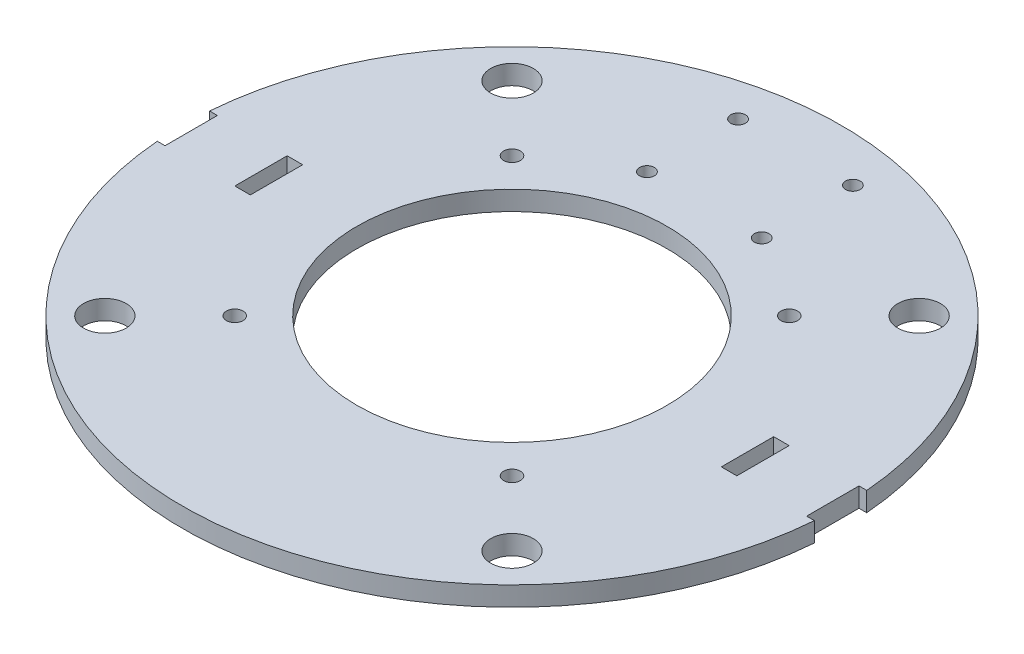
ISO-10303-21;
HEADER;
FILE_DESCRIPTION(('STEP AP214'),'2;1');
FILE_NAME('part.step','',(''),(''),'','','');
FILE_SCHEMA(('AUTOMOTIVE_DESIGN { 1 0 10303 214 1 1 1 1 }'));
ENDSEC;
DATA;
#1=APPLICATION_CONTEXT('core data for automotive mechanical design processes');
#2=APPLICATION_PROTOCOL_DEFINITION('international standard','automotive_design',2000,#1);
#3=PRODUCT_CONTEXT('',#1,'mechanical');
#4=PRODUCT('Part','Part','',(#3));
#5=PRODUCT_RELATED_PRODUCT_CATEGORY('part','',(#4));
#6=PRODUCT_DEFINITION_FORMATION('','',#4);
#7=PRODUCT_DEFINITION_CONTEXT('part definition',#1,'design');
#8=PRODUCT_DEFINITION('design','',#6,#7);
#9=PRODUCT_DEFINITION_SHAPE('','',#8);
#10=(LENGTH_UNIT() NAMED_UNIT(*) SI_UNIT(.MILLI.,.METRE.));
#11=(NAMED_UNIT(*) PLANE_ANGLE_UNIT() SI_UNIT($,.RADIAN.));
#12=(NAMED_UNIT(*) SI_UNIT($,.STERADIAN.) SOLID_ANGLE_UNIT());
#13=UNCERTAINTY_MEASURE_WITH_UNIT(LENGTH_MEASURE(1.E-05),#10,'distance_accuracy_value','');
#14=(GEOMETRIC_REPRESENTATION_CONTEXT(3) GLOBAL_UNCERTAINTY_ASSIGNED_CONTEXT((#13)) GLOBAL_UNIT_ASSIGNED_CONTEXT((#10,
#11,#12)) REPRESENTATION_CONTEXT('',''));
#15=CARTESIAN_POINT('',(0.,0.,0.));
#16=DIRECTION('',(0.,0.,1.));
#17=DIRECTION('',(1.,0.,0.));
#18=AXIS2_PLACEMENT_3D('',#15,#16,#17);
#19=CARTESIAN_POINT('',(0.,5.,0.));
#20=DIRECTION('',(0.,-1.,0.));
#21=DIRECTION('',(0.,0.,-1.));
#22=AXIS2_PLACEMENT_3D('',#19,#20,#21);
#23=CYLINDRICAL_SURFACE('',#22,85.);
#24=DIRECTION('',(0.,1.,0.));
#25=VECTOR('',#24,1.);
#26=CARTESIAN_POINT('',(84.7315614160391,-0.00100000000000013,6.75));
#27=LINE('',#26,#25);
#28=CARTESIAN_POINT('',(84.7315614160391,0.,6.75));
#29=VERTEX_POINT('',#28);
#30=CARTESIAN_POINT('',(84.7315614160391,5.,6.75));
#31=VERTEX_POINT('',#30);
#32=EDGE_CURVE('E177',#29,#31,#27,.T.);
#33=ORIENTED_EDGE('',*,*,#32,.T.);
#34=CARTESIAN_POINT('',(0.,5.,0.));
#35=DIRECTION('',(0.,1.,0.));
#36=DIRECTION('',(0.,0.,1.));
#37=AXIS2_PLACEMENT_3D('',#34,#35,#36);
#38=CIRCLE('',#37,85.);
#39=CARTESIAN_POINT('',(-84.7315614160391,5.,6.75));
#40=VERTEX_POINT('',#39);
#41=EDGE_CURVE('E43',#40,#31,#38,.T.);
#42=ORIENTED_EDGE('',*,*,#41,.F.);
#43=DIRECTION('',(0.,1.,0.));
#44=VECTOR('',#43,1.);
#45=CARTESIAN_POINT('',(-84.7315614160391,-0.00100000000000013,6.75));
#46=LINE('',#45,#44);
#47=CARTESIAN_POINT('',(-84.7315614160391,0.,6.75));
#48=VERTEX_POINT('',#47);
#49=EDGE_CURVE('E213',#48,#40,#46,.T.);
#50=ORIENTED_EDGE('',*,*,#49,.F.);
#51=CARTESIAN_POINT('',(0.,0.,0.));
#52=DIRECTION('',(0.,1.,0.));
#53=DIRECTION('',(0.,0.,1.));
#54=AXIS2_PLACEMENT_3D('',#51,#52,#53);
#55=CIRCLE('',#54,85.);
#56=EDGE_CURVE('E255',#48,#29,#55,.T.);
#57=ORIENTED_EDGE('',*,*,#56,.T.);
#58=EDGE_LOOP('',(#33,#42,#50,#57));
#59=FACE_BOUND('',#58,.T.);
#60=ADVANCED_FACE('F34',(#59),#23,.T.);
#61=CARTESIAN_POINT('',(0.,5.,0.));
#62=DIRECTION('',(0.,1.,0.));
#63=DIRECTION('',(0.,0.,1.));
#64=AXIS2_PLACEMENT_3D('',#61,#62,#63);
#65=PLANE('',#64);
#66=CARTESIAN_POINT('',(-52.5,5.,-52.5));
#67=DIRECTION('',(0.,1.,0.));
#68=DIRECTION('',(0.,0.,-1.));
#69=AXIS2_PLACEMENT_3D('',#66,#67,#68);
#70=CIRCLE('',#69,5.49999999999999);
#71=CARTESIAN_POINT('',(-52.5,5.,-58.));
#72=VERTEX_POINT('',#71);
#73=EDGE_CURVE('E470',#72,#72,#70,.T.);
#74=ORIENTED_EDGE('',*,*,#73,.F.);
#75=EDGE_LOOP('',(#74));
#76=FACE_BOUND('',#75,.T.);
#77=CARTESIAN_POINT('',(52.5,5.,52.5));
#78=DIRECTION('',(0.,1.,0.));
#79=DIRECTION('',(0.,0.,-1.));
#80=AXIS2_PLACEMENT_3D('',#77,#78,#79);
#81=CIRCLE('',#80,5.49999999999999);
#82=CARTESIAN_POINT('',(52.5,5.,47.));
#83=VERTEX_POINT('',#82);
#84=EDGE_CURVE('E463',#83,#83,#81,.T.);
#85=ORIENTED_EDGE('',*,*,#84,.F.);
#86=EDGE_LOOP('',(#85));
#87=FACE_BOUND('',#86,.T.);
#88=CARTESIAN_POINT('',(-52.5,5.,52.5));
#89=DIRECTION('',(0.,1.,0.));
#90=DIRECTION('',(0.,0.,1.));
#91=AXIS2_PLACEMENT_3D('',#88,#89,#90);
#92=CIRCLE('',#91,5.49999999999999);
#93=CARTESIAN_POINT('',(-52.5,5.,58.));
#94=VERTEX_POINT('',#93);
#95=EDGE_CURVE('E458',#94,#94,#92,.T.);
#96=ORIENTED_EDGE('',*,*,#95,.F.);
#97=EDGE_LOOP('',(#96));
#98=FACE_BOUND('',#97,.T.);
#99=CARTESIAN_POINT('',(52.5,5.,-52.5));
#100=DIRECTION('',(0.,1.,0.));
#101=DIRECTION('',(0.,0.,1.));
#102=AXIS2_PLACEMENT_3D('',#99,#100,#101);
#103=CIRCLE('',#102,5.49999999999999);
#104=CARTESIAN_POINT('',(52.5,5.,-47.));
#105=VERTEX_POINT('',#104);
#106=EDGE_CURVE('E475',#105,#105,#103,.T.);
#107=ORIENTED_EDGE('',*,*,#106,.F.);
#108=EDGE_LOOP('',(#107));
#109=FACE_BOUND('',#108,.T.);
#110=CARTESIAN_POINT('',(0.,5.,0.));
#111=DIRECTION('',(0.,1.,0.));
#112=DIRECTION('',(0.,0.,1.));
#113=AXIS2_PLACEMENT_3D('',#110,#111,#112);
#114=CIRCLE('',#113,40.);
#115=CARTESIAN_POINT('',(0.,5.,40.));
#116=VERTEX_POINT('',#115);
#117=EDGE_CURVE('E484',#116,#116,#114,.T.);
#118=ORIENTED_EDGE('',*,*,#117,.F.);
#119=EDGE_LOOP('',(#118));
#120=FACE_BOUND('',#119,.T.);
#121=CARTESIAN_POINT('',(-35.75,5.,-35.75));
#122=DIRECTION('',(0.,1.,0.));
#123=DIRECTION('',(0.,0.,-1.));
#124=AXIS2_PLACEMENT_3D('',#121,#122,#123);
#125=CIRCLE('',#124,2.15);
#126=CARTESIAN_POINT('',(-35.75,5.,-37.9));
#127=VERTEX_POINT('',#126);
#128=EDGE_CURVE('E491',#127,#127,#125,.T.);
#129=ORIENTED_EDGE('',*,*,#128,.F.);
#130=EDGE_LOOP('',(#129));
#131=FACE_BOUND('',#130,.T.);
#132=CARTESIAN_POINT('',(35.75,5.,35.75));
#133=DIRECTION('',(0.,1.,0.));
#134=DIRECTION('',(0.,0.,-1.));
#135=AXIS2_PLACEMENT_3D('',#132,#133,#134);
#136=CIRCLE('',#135,2.15);
#137=CARTESIAN_POINT('',(35.75,5.,33.6));
#138=VERTEX_POINT('',#137);
#139=EDGE_CURVE('E490',#138,#138,#136,.T.);
#140=ORIENTED_EDGE('',*,*,#139,.F.);
#141=EDGE_LOOP('',(#140));
#142=FACE_BOUND('',#141,.T.);
#143=CARTESIAN_POINT('',(-35.75,5.,35.75));
#144=DIRECTION('',(0.,1.,0.));
#145=DIRECTION('',(0.,0.,1.));
#146=AXIS2_PLACEMENT_3D('',#143,#144,#145);
#147=CIRCLE('',#146,2.15);
#148=CARTESIAN_POINT('',(-35.75,5.,37.9));
#149=VERTEX_POINT('',#148);
#150=EDGE_CURVE('E487',#149,#149,#147,.T.);
#151=ORIENTED_EDGE('',*,*,#150,.F.);
#152=EDGE_LOOP('',(#151));
#153=FACE_BOUND('',#152,.T.);
#154=CARTESIAN_POINT('',(35.75,5.,-35.75));
#155=DIRECTION('',(0.,1.,0.));
#156=DIRECTION('',(0.,0.,1.));
#157=AXIS2_PLACEMENT_3D('',#154,#155,#156);
#158=CIRCLE('',#157,2.15);
#159=CARTESIAN_POINT('',(35.75,5.,-33.6));
#160=VERTEX_POINT('',#159);
#161=EDGE_CURVE('E265',#160,#160,#158,.T.);
#162=ORIENTED_EDGE('',*,*,#161,.F.);
#163=EDGE_LOOP('',(#162));
#164=FACE_BOUND('',#163,.T.);
#165=CARTESIAN_POINT('',(-14.8,5.,-73.1));
#166=DIRECTION('',(0.,1.,0.));
#167=DIRECTION('',(0.,0.,-1.));
#168=AXIS2_PLACEMENT_3D('',#165,#166,#167);
#169=CIRCLE('',#168,1.89999999999999);
#170=CARTESIAN_POINT('',(-14.8,5.,-75.));
#171=VERTEX_POINT('',#170);
#172=EDGE_CURVE('E272',#171,#171,#169,.T.);
#173=ORIENTED_EDGE('',*,*,#172,.F.);
#174=EDGE_LOOP('',(#173));
#175=FACE_BOUND('',#174,.T.);
#176=CARTESIAN_POINT('',(-14.8,5.,-49.6));
#177=DIRECTION('',(0.,1.,0.));
#178=DIRECTION('',(0.,0.,-1.));
#179=AXIS2_PLACEMENT_3D('',#176,#177,#178);
#180=CIRCLE('',#179,1.89999999999999);
#181=CARTESIAN_POINT('',(-14.8,5.,-51.5));
#182=VERTEX_POINT('',#181);
#183=EDGE_CURVE('E281',#182,#182,#180,.T.);
#184=ORIENTED_EDGE('',*,*,#183,.F.);
#185=EDGE_LOOP('',(#184));
#186=FACE_BOUND('',#185,.T.);
#187=CARTESIAN_POINT('',(14.8,5.,-49.6));
#188=DIRECTION('',(0.,1.,0.));
#189=DIRECTION('',(0.,0.,1.));
#190=AXIS2_PLACEMENT_3D('',#187,#188,#189);
#191=CIRCLE('',#190,1.89999999999999);
#192=CARTESIAN_POINT('',(14.8,5.,-47.7));
#193=VERTEX_POINT('',#192);
#194=EDGE_CURVE('E498',#193,#193,#191,.T.);
#195=ORIENTED_EDGE('',*,*,#194,.F.);
#196=EDGE_LOOP('',(#195));
#197=FACE_BOUND('',#196,.T.);
#198=CARTESIAN_POINT('',(14.8,5.,-73.1));
#199=DIRECTION('',(0.,1.,0.));
#200=DIRECTION('',(0.,0.,1.));
#201=AXIS2_PLACEMENT_3D('',#198,#199,#200);
#202=CIRCLE('',#201,1.9);
#203=CARTESIAN_POINT('',(14.8,5.,-71.2));
#204=VERTEX_POINT('',#203);
#205=EDGE_CURVE('E287',#204,#204,#202,.T.);
#206=ORIENTED_EDGE('',*,*,#205,.F.);
#207=EDGE_LOOP('',(#206));
#208=FACE_BOUND('',#207,.T.);
#209=DIRECTION('',(0.,0.,1.));
#210=VECTOR('',#209,1.);
#211=CARTESIAN_POINT('',(64.7315614160391,5.,0.));
#212=LINE('',#211,#210);
#213=CARTESIAN_POINT('',(64.7315614160391,5.,-6.75));
#214=VERTEX_POINT('',#213);
#215=CARTESIAN_POINT('',(64.7315614160391,5.,6.75));
#216=VERTEX_POINT('',#215);
#217=EDGE_CURVE('E236',#214,#216,#212,.T.);
#218=ORIENTED_EDGE('',*,*,#217,.T.);
#219=DIRECTION('',(-1.,0.,0.));
#220=VECTOR('',#219,1.);
#221=CARTESIAN_POINT('',(0.,5.,6.75));
#222=LINE('',#221,#220);
#223=CARTESIAN_POINT('',(60.7315614160391,5.,6.75));
#224=VERTEX_POINT('',#223);
#225=EDGE_CURVE('E59',#216,#224,#222,.T.);
#226=ORIENTED_EDGE('',*,*,#225,.T.);
#227=DIRECTION('',(0.,0.,1.));
#228=VECTOR('',#227,1.);
#229=CARTESIAN_POINT('',(60.7315614160391,5.,0.));
#230=LINE('',#229,#228);
#231=CARTESIAN_POINT('',(60.7315614160391,5.,-6.75));
#232=VERTEX_POINT('',#231);
#233=EDGE_CURVE('E242',#232,#224,#230,.T.);
#234=ORIENTED_EDGE('',*,*,#233,.F.);
#235=DIRECTION('',(-1.,0.,0.));
#236=VECTOR('',#235,1.);
#237=CARTESIAN_POINT('',(0.,5.,-6.75));
#238=LINE('',#237,#236);
#239=EDGE_CURVE('E239',#214,#232,#238,.T.);
#240=ORIENTED_EDGE('',*,*,#239,.F.);
#241=EDGE_LOOP('',(#218,#226,#234,#240));
#242=FACE_BOUND('',#241,.T.);
#243=DIRECTION('',(0.,0.,1.));
#244=VECTOR('',#243,1.);
#245=CARTESIAN_POINT('',(-64.7315614160391,5.,-6.75));
#246=LINE('',#245,#244);
#247=CARTESIAN_POINT('',(-64.7315614160391,5.,-6.75));
#248=VERTEX_POINT('',#247);
#249=CARTESIAN_POINT('',(-64.7315614160391,5.,6.75));
#250=VERTEX_POINT('',#249);
#251=EDGE_CURVE('E299',#248,#250,#246,.T.);
#252=ORIENTED_EDGE('',*,*,#251,.F.);
#253=DIRECTION('',(1.,0.,0.));
#254=VECTOR('',#253,1.);
#255=CARTESIAN_POINT('',(-64.7315614160391,5.,-6.75));
#256=LINE('',#255,#254);
#257=CARTESIAN_POINT('',(-60.7315614160391,5.,-6.75));
#258=VERTEX_POINT('',#257);
#259=EDGE_CURVE('E51',#248,#258,#256,.T.);
#260=ORIENTED_EDGE('',*,*,#259,.T.);
#261=DIRECTION('',(0.,0.,1.));
#262=VECTOR('',#261,1.);
#263=CARTESIAN_POINT('',(-60.7315614160391,5.,-6.75));
#264=LINE('',#263,#262);
#265=CARTESIAN_POINT('',(-60.7315614160391,5.,6.75));
#266=VERTEX_POINT('',#265);
#267=EDGE_CURVE('E157',#258,#266,#264,.T.);
#268=ORIENTED_EDGE('',*,*,#267,.T.);
#269=DIRECTION('',(1.,0.,0.));
#270=VECTOR('',#269,1.);
#271=CARTESIAN_POINT('',(-64.7315614160391,5.,6.75));
#272=LINE('',#271,#270);
#273=EDGE_CURVE('E302',#250,#266,#272,.T.);
#274=ORIENTED_EDGE('',*,*,#273,.F.);
#275=EDGE_LOOP('',(#252,#260,#268,#274));
#276=FACE_BOUND('',#275,.T.);
#277=ORIENTED_EDGE('',*,*,#41,.T.);
#278=DIRECTION('',(-1.,0.,0.));
#279=VECTOR('',#278,1.);
#280=CARTESIAN_POINT('',(0.,5.,6.75));
#281=LINE('',#280,#279);
#282=CARTESIAN_POINT('',(82.7315614160391,5.,6.75));
#283=VERTEX_POINT('',#282);
#284=EDGE_CURVE('E193',#31,#283,#281,.T.);
#285=ORIENTED_EDGE('',*,*,#284,.T.);
#286=DIRECTION('',(0.,0.,1.));
#287=VECTOR('',#286,1.);
#288=CARTESIAN_POINT('',(82.7315614160391,5.,0.));
#289=LINE('',#288,#287);
#290=CARTESIAN_POINT('',(82.7315614160391,5.,-6.75));
#291=VERTEX_POINT('',#290);
#292=EDGE_CURVE('E180',#291,#283,#289,.T.);
#293=ORIENTED_EDGE('',*,*,#292,.F.);
#294=DIRECTION('',(-1.,0.,0.));
#295=VECTOR('',#294,1.);
#296=CARTESIAN_POINT('',(0.,5.,-6.75));
#297=LINE('',#296,#295);
#298=CARTESIAN_POINT('',(84.7315614160391,5.,-6.75));
#299=VERTEX_POINT('',#298);
#300=EDGE_CURVE('E190',#299,#291,#297,.T.);
#301=ORIENTED_EDGE('',*,*,#300,.F.);
#302=CARTESIAN_POINT('',(-84.7315614160391,5.,-6.75));
#303=VERTEX_POINT('',#302);
#304=EDGE_CURVE('E11',#299,#303,#38,.T.);
#305=ORIENTED_EDGE('',*,*,#304,.T.);
#306=DIRECTION('',(1.,0.,0.));
#307=VECTOR('',#306,1.);
#308=CARTESIAN_POINT('',(0.,5.,-6.75));
#309=LINE('',#308,#307);
#310=CARTESIAN_POINT('',(-82.7315614160391,5.,-6.75));
#311=VERTEX_POINT('',#310);
#312=EDGE_CURVE('E218',#303,#311,#309,.T.);
#313=ORIENTED_EDGE('',*,*,#312,.T.);
#314=DIRECTION('',(0.,0.,1.));
#315=VECTOR('',#314,1.);
#316=CARTESIAN_POINT('',(-82.7315614160391,5.,0.));
#317=LINE('',#316,#315);
#318=CARTESIAN_POINT('',(-82.7315614160391,5.,6.75));
#319=VERTEX_POINT('',#318);
#320=EDGE_CURVE('E221',#311,#319,#317,.T.);
#321=ORIENTED_EDGE('',*,*,#320,.T.);
#322=DIRECTION('',(1.,0.,0.));
#323=VECTOR('',#322,1.);
#324=CARTESIAN_POINT('',(0.,5.,6.75));
#325=LINE('',#324,#323);
#326=EDGE_CURVE('E209',#40,#319,#325,.T.);
#327=ORIENTED_EDGE('',*,*,#326,.F.);
#328=EDGE_LOOP('',(#277,#285,#293,#301,#305,#313,#321,#327));
#329=FACE_BOUND('',#328,.T.);
#330=ADVANCED_FACE('F307',(#76,#87,#98,#109,#120,#131,#142,#153,#164,#175,#186,#197,#208,#242,
#276,#329),#65,.T.);
#331=CARTESIAN_POINT('',(0.,0.,0.));
#332=DIRECTION('',(0.,1.,0.));
#333=DIRECTION('',(0.,0.,1.));
#334=AXIS2_PLACEMENT_3D('',#331,#332,#333);
#335=PLANE('',#334);
#336=CARTESIAN_POINT('',(-52.5,0.,-52.5));
#337=DIRECTION('',(0.,1.,0.));
#338=DIRECTION('',(0.,0.,1.));
#339=AXIS2_PLACEMENT_3D('',#336,#337,#338);
#340=CIRCLE('',#339,5.49999999999999);
#341=CARTESIAN_POINT('',(-52.5,0.,-47.));
#342=VERTEX_POINT('',#341);
#343=EDGE_CURVE('E473',#342,#342,#340,.F.);
#344=ORIENTED_EDGE('',*,*,#343,.F.);
#345=EDGE_LOOP('',(#344));
#346=FACE_BOUND('',#345,.T.);
#347=CARTESIAN_POINT('',(52.5,0.,52.5));
#348=DIRECTION('',(0.,1.,0.));
#349=DIRECTION('',(0.,0.,1.));
#350=AXIS2_PLACEMENT_3D('',#347,#348,#349);
#351=CIRCLE('',#350,5.49999999999999);
#352=CARTESIAN_POINT('',(52.5,0.,58.));
#353=VERTEX_POINT('',#352);
#354=EDGE_CURVE('E466',#353,#353,#351,.F.);
#355=ORIENTED_EDGE('',*,*,#354,.F.);
#356=EDGE_LOOP('',(#355));
#357=FACE_BOUND('',#356,.T.);
#358=CARTESIAN_POINT('',(-52.5,0.,52.5));
#359=DIRECTION('',(0.,1.,0.));
#360=DIRECTION('',(0.,0.,1.));
#361=AXIS2_PLACEMENT_3D('',#358,#359,#360);
#362=CIRCLE('',#361,5.49999999999999);
#363=CARTESIAN_POINT('',(-52.5,0.,58.));
#364=VERTEX_POINT('',#363);
#365=EDGE_CURVE('E461',#364,#364,#362,.F.);
#366=ORIENTED_EDGE('',*,*,#365,.F.);
#367=EDGE_LOOP('',(#366));
#368=FACE_BOUND('',#367,.T.);
#369=CARTESIAN_POINT('',(52.5,0.,-52.5));
#370=DIRECTION('',(0.,1.,0.));
#371=DIRECTION('',(0.,0.,1.));
#372=AXIS2_PLACEMENT_3D('',#369,#370,#371);
#373=CIRCLE('',#372,5.49999999999999);
#374=CARTESIAN_POINT('',(52.5,0.,-47.));
#375=VERTEX_POINT('',#374);
#376=EDGE_CURVE('E481',#375,#375,#373,.F.);
#377=ORIENTED_EDGE('',*,*,#376,.F.);
#378=EDGE_LOOP('',(#377));
#379=FACE_BOUND('',#378,.T.);
#380=CARTESIAN_POINT('',(0.,0.,0.));
#381=DIRECTION('',(0.,1.,0.));
#382=DIRECTION('',(0.,0.,1.));
#383=AXIS2_PLACEMENT_3D('',#380,#381,#382);
#384=CIRCLE('',#383,40.);
#385=CARTESIAN_POINT('',(0.,0.,40.));
#386=VERTEX_POINT('',#385);
#387=EDGE_CURVE('E38',#386,#386,#384,.T.);
#388=ORIENTED_EDGE('',*,*,#387,.T.);
#389=EDGE_LOOP('',(#388));
#390=FACE_BOUND('',#389,.T.);
#391=CARTESIAN_POINT('',(-35.75,0.,-35.75));
#392=DIRECTION('',(0.,1.,0.));
#393=DIRECTION('',(0.,0.,1.));
#394=AXIS2_PLACEMENT_3D('',#391,#392,#393);
#395=CIRCLE('',#394,2.15);
#396=CARTESIAN_POINT('',(-35.75,0.,-33.6));
#397=VERTEX_POINT('',#396);
#398=EDGE_CURVE('E270',#397,#397,#395,.T.);
#399=ORIENTED_EDGE('',*,*,#398,.T.);
#400=EDGE_LOOP('',(#399));
#401=FACE_BOUND('',#400,.T.);
#402=CARTESIAN_POINT('',(35.75,0.,35.75));
#403=DIRECTION('',(0.,1.,0.));
#404=DIRECTION('',(0.,0.,1.));
#405=AXIS2_PLACEMENT_3D('',#402,#403,#404);
#406=CIRCLE('',#405,2.15);
#407=CARTESIAN_POINT('',(35.75,0.,37.9));
#408=VERTEX_POINT('',#407);
#409=EDGE_CURVE('E268',#408,#408,#406,.T.);
#410=ORIENTED_EDGE('',*,*,#409,.T.);
#411=EDGE_LOOP('',(#410));
#412=FACE_BOUND('',#411,.T.);
#413=CARTESIAN_POINT('',(-35.75,0.,35.75));
#414=DIRECTION('',(0.,1.,0.));
#415=DIRECTION('',(0.,0.,1.));
#416=AXIS2_PLACEMENT_3D('',#413,#414,#415);
#417=CIRCLE('',#416,2.15);
#418=CARTESIAN_POINT('',(-35.75,0.,37.9));
#419=VERTEX_POINT('',#418);
#420=EDGE_CURVE('E264',#419,#419,#417,.T.);
#421=ORIENTED_EDGE('',*,*,#420,.T.);
#422=EDGE_LOOP('',(#421));
#423=FACE_BOUND('',#422,.T.);
#424=CARTESIAN_POINT('',(35.75,0.,-35.75));
#425=DIRECTION('',(0.,1.,0.));
#426=DIRECTION('',(0.,0.,1.));
#427=AXIS2_PLACEMENT_3D('',#424,#425,#426);
#428=CIRCLE('',#427,2.15);
#429=CARTESIAN_POINT('',(35.75,0.,-33.6));
#430=VERTEX_POINT('',#429);
#431=EDGE_CURVE('E261',#430,#430,#428,.T.);
#432=ORIENTED_EDGE('',*,*,#431,.T.);
#433=EDGE_LOOP('',(#432));
#434=FACE_BOUND('',#433,.T.);
#435=CARTESIAN_POINT('',(-14.8,0.,-73.1));
#436=DIRECTION('',(0.,1.,0.));
#437=DIRECTION('',(0.,0.,1.));
#438=AXIS2_PLACEMENT_3D('',#435,#436,#437);
#439=CIRCLE('',#438,1.89999999999999);
#440=CARTESIAN_POINT('',(-14.8,0.,-71.2));
#441=VERTEX_POINT('',#440);
#442=EDGE_CURVE('E276',#441,#441,#439,.F.);
#443=ORIENTED_EDGE('',*,*,#442,.F.);
#444=EDGE_LOOP('',(#443));
#445=FACE_BOUND('',#444,.T.);
#446=CARTESIAN_POINT('',(-14.8,0.,-49.6));
#447=DIRECTION('',(0.,1.,0.));
#448=DIRECTION('',(0.,0.,1.));
#449=AXIS2_PLACEMENT_3D('',#446,#447,#448);
#450=CIRCLE('',#449,1.89999999999999);
#451=CARTESIAN_POINT('',(-14.8,0.,-47.7));
#452=VERTEX_POINT('',#451);
#453=EDGE_CURVE('E284',#452,#452,#450,.F.);
#454=ORIENTED_EDGE('',*,*,#453,.F.);
#455=EDGE_LOOP('',(#454));
#456=FACE_BOUND('',#455,.T.);
#457=CARTESIAN_POINT('',(14.8,0.,-49.6));
#458=DIRECTION('',(0.,1.,0.));
#459=DIRECTION('',(0.,0.,1.));
#460=AXIS2_PLACEMENT_3D('',#457,#458,#459);
#461=CIRCLE('',#460,1.89999999999999);
#462=CARTESIAN_POINT('',(14.8,0.,-47.7));
#463=VERTEX_POINT('',#462);
#464=EDGE_CURVE('E291',#463,#463,#461,.F.);
#465=ORIENTED_EDGE('',*,*,#464,.F.);
#466=EDGE_LOOP('',(#465));
#467=FACE_BOUND('',#466,.T.);
#468=CARTESIAN_POINT('',(14.8,0.,-73.1));
#469=DIRECTION('',(0.,1.,0.));
#470=DIRECTION('',(0.,0.,1.));
#471=AXIS2_PLACEMENT_3D('',#468,#469,#470);
#472=CIRCLE('',#471,1.9);
#473=CARTESIAN_POINT('',(14.8,0.,-71.2));
#474=VERTEX_POINT('',#473);
#475=EDGE_CURVE('E290',#474,#474,#472,.F.);
#476=ORIENTED_EDGE('',*,*,#475,.F.);
#477=EDGE_LOOP('',(#476));
#478=FACE_BOUND('',#477,.T.);
#479=DIRECTION('',(-1.,0.,0.));
#480=VECTOR('',#479,1.);
#481=CARTESIAN_POINT('',(-64.7315614160391,0.,-6.75));
#482=LINE('',#481,#480);
#483=CARTESIAN_POINT('',(-60.7315614160391,0.,-6.75));
#484=VERTEX_POINT('',#483);
#485=CARTESIAN_POINT('',(-64.7315614160391,0.,-6.75));
#486=VERTEX_POINT('',#485);
#487=EDGE_CURVE('E162',#484,#486,#482,.T.);
#488=ORIENTED_EDGE('',*,*,#487,.T.);
#489=DIRECTION('',(0.,0.,-1.));
#490=VECTOR('',#489,1.);
#491=CARTESIAN_POINT('',(-64.7315614160391,0.,-6.75));
#492=LINE('',#491,#490);
#493=CARTESIAN_POINT('',(-64.7315614160391,0.,6.75));
#494=VERTEX_POINT('',#493);
#495=EDGE_CURVE('E159',#494,#486,#492,.T.);
#496=ORIENTED_EDGE('',*,*,#495,.F.);
#497=DIRECTION('',(-1.,0.,0.));
#498=VECTOR('',#497,1.);
#499=CARTESIAN_POINT('',(-64.7315614160391,0.,6.75));
#500=LINE('',#499,#498);
#501=CARTESIAN_POINT('',(-60.7315614160391,0.,6.75));
#502=VERTEX_POINT('',#501);
#503=EDGE_CURVE('E171',#502,#494,#500,.T.);
#504=ORIENTED_EDGE('',*,*,#503,.F.);
#505=DIRECTION('',(0.,0.,-1.));
#506=VECTOR('',#505,1.);
#507=CARTESIAN_POINT('',(-60.7315614160391,0.,-6.75));
#508=LINE('',#507,#506);
#509=EDGE_CURVE('E154',#502,#484,#508,.T.);
#510=ORIENTED_EDGE('',*,*,#509,.T.);
#511=EDGE_LOOP('',(#488,#496,#504,#510));
#512=FACE_BOUND('',#511,.T.);
#513=DIRECTION('',(1.,0.,0.));
#514=VECTOR('',#513,1.);
#515=CARTESIAN_POINT('',(0.,0.,6.75));
#516=LINE('',#515,#514);
#517=CARTESIAN_POINT('',(60.7315614160391,0.,6.75));
#518=VERTEX_POINT('',#517);
#519=CARTESIAN_POINT('',(64.7315614160391,0.,6.75));
#520=VERTEX_POINT('',#519);
#521=EDGE_CURVE('E232',#518,#520,#516,.T.);
#522=ORIENTED_EDGE('',*,*,#521,.T.);
#523=DIRECTION('',(0.,0.,-1.));
#524=VECTOR('',#523,1.);
#525=CARTESIAN_POINT('',(64.7315614160391,0.,0.));
#526=LINE('',#525,#524);
#527=CARTESIAN_POINT('',(64.7315614160391,0.,-6.75));
#528=VERTEX_POINT('',#527);
#529=EDGE_CURVE('E248',#520,#528,#526,.T.);
#530=ORIENTED_EDGE('',*,*,#529,.T.);
#531=DIRECTION('',(1.,0.,0.));
#532=VECTOR('',#531,1.);
#533=CARTESIAN_POINT('',(0.,0.,-6.75));
#534=LINE('',#533,#532);
#535=CARTESIAN_POINT('',(60.7315614160391,0.,-6.75));
#536=VERTEX_POINT('',#535);
#537=EDGE_CURVE('E203',#536,#528,#534,.T.);
#538=ORIENTED_EDGE('',*,*,#537,.F.);
#539=DIRECTION('',(0.,0.,-1.));
#540=VECTOR('',#539,1.);
#541=CARTESIAN_POINT('',(60.7315614160391,0.,0.));
#542=LINE('',#541,#540);
#543=EDGE_CURVE('E230',#518,#536,#542,.T.);
#544=ORIENTED_EDGE('',*,*,#543,.F.);
#545=EDGE_LOOP('',(#522,#530,#538,#544));
#546=FACE_BOUND('',#545,.T.);
#547=DIRECTION('',(1.,0.,0.));
#548=VECTOR('',#547,1.);
#549=CARTESIAN_POINT('',(0.,0.,6.75));
#550=LINE('',#549,#548);
#551=CARTESIAN_POINT('',(82.7315614160391,0.,6.75));
#552=VERTEX_POINT('',#551);
#553=EDGE_CURVE('E196',#552,#29,#550,.T.);
#554=ORIENTED_EDGE('',*,*,#553,.T.);
#555=ORIENTED_EDGE('',*,*,#56,.F.);
#556=DIRECTION('',(-1.,0.,0.));
#557=VECTOR('',#556,1.);
#558=CARTESIAN_POINT('',(0.,0.,6.75));
#559=LINE('',#558,#557);
#560=CARTESIAN_POINT('',(-82.7315614160391,0.,6.75));
#561=VERTEX_POINT('',#560);
#562=EDGE_CURVE('E224',#561,#48,#559,.T.);
#563=ORIENTED_EDGE('',*,*,#562,.F.);
#564=DIRECTION('',(0.,0.,-1.));
#565=VECTOR('',#564,1.);
#566=CARTESIAN_POINT('',(-82.7315614160391,0.,0.));
#567=LINE('',#566,#565);
#568=CARTESIAN_POINT('',(-82.7315614160391,0.,-6.75));
#569=VERTEX_POINT('',#568);
#570=EDGE_CURVE('E187',#561,#569,#567,.T.);
#571=ORIENTED_EDGE('',*,*,#570,.T.);
#572=DIRECTION('',(-1.,0.,0.));
#573=VECTOR('',#572,1.);
#574=CARTESIAN_POINT('',(0.,0.,-6.75));
#575=LINE('',#574,#573);
#576=CARTESIAN_POINT('',(-84.7315614160391,0.,-6.75));
#577=VERTEX_POINT('',#576);
#578=EDGE_CURVE('E173',#569,#577,#575,.T.);
#579=ORIENTED_EDGE('',*,*,#578,.T.);
#580=CARTESIAN_POINT('',(84.7315614160391,0.,-6.75));
#581=VERTEX_POINT('',#580);
#582=EDGE_CURVE('E258',#581,#577,#55,.T.);
#583=ORIENTED_EDGE('',*,*,#582,.F.);
#584=DIRECTION('',(1.,0.,0.));
#585=VECTOR('',#584,1.);
#586=CARTESIAN_POINT('',(0.,0.,-6.75));
#587=LINE('',#586,#585);
#588=CARTESIAN_POINT('',(82.7315614160391,0.,-6.75));
#589=VERTEX_POINT('',#588);
#590=EDGE_CURVE('E201',#589,#581,#587,.T.);
#591=ORIENTED_EDGE('',*,*,#590,.F.);
#592=DIRECTION('',(0.,0.,-1.));
#593=VECTOR('',#592,1.);
#594=CARTESIAN_POINT('',(82.7315614160391,0.,0.));
#595=LINE('',#594,#593);
#596=EDGE_CURVE('E199',#552,#589,#595,.T.);
#597=ORIENTED_EDGE('',*,*,#596,.F.);
#598=EDGE_LOOP('',(#554,#555,#563,#571,#579,#583,#591,#597));
#599=FACE_BOUND('',#598,.T.);
#600=ADVANCED_FACE('F169',(#346,#357,#368,#379,#390,#401,#412,#423,#434,#445,#456,#467,#478,
#512,#546,#599),#335,.F.);
#601=ORIENTED_EDGE('',*,*,#304,.F.);
#602=DIRECTION('',(0.,1.,0.));
#603=VECTOR('',#602,1.);
#604=CARTESIAN_POINT('',(84.7315614160391,-0.00100000000000013,-6.75));
#605=LINE('',#604,#603);
#606=EDGE_CURVE('E181',#581,#299,#605,.T.);
#607=ORIENTED_EDGE('',*,*,#606,.F.);
#608=ORIENTED_EDGE('',*,*,#582,.T.);
#609=DIRECTION('',(0.,1.,0.));
#610=VECTOR('',#609,1.);
#611=CARTESIAN_POINT('',(-84.7315614160391,-0.00100000000000013,-6.75));
#612=LINE('',#611,#610);
#613=EDGE_CURVE('E210',#577,#303,#612,.T.);
#614=ORIENTED_EDGE('',*,*,#613,.T.);
#615=EDGE_LOOP('',(#601,#607,#608,#614));
#616=FACE_BOUND('',#615,.T.);
#617=ADVANCED_FACE('F36',(#616),#23,.T.);
#618=CARTESIAN_POINT('',(0.,-0.00100000000000013,6.75));
#619=DIRECTION('',(0.,0.,-1.));
#620=DIRECTION('',(-1.,0.,0.));
#621=AXIS2_PLACEMENT_3D('',#618,#619,#620);
#622=PLANE('',#621);
#623=DIRECTION('',(0.,1.,0.));
#624=VECTOR('',#623,1.);
#625=CARTESIAN_POINT('',(60.7315614160391,-0.00100000000000013,6.75));
#626=LINE('',#625,#624);
#627=EDGE_CURVE('E246',#518,#224,#626,.T.);
#628=ORIENTED_EDGE('',*,*,#627,.T.);
#629=ORIENTED_EDGE('',*,*,#225,.F.);
#630=DIRECTION('',(0.,1.,0.));
#631=VECTOR('',#630,1.);
#632=CARTESIAN_POINT('',(64.7315614160391,-0.00100000000000013,6.75));
#633=LINE('',#632,#631);
#634=EDGE_CURVE('E245',#520,#216,#633,.T.);
#635=ORIENTED_EDGE('',*,*,#634,.F.);
#636=ORIENTED_EDGE('',*,*,#521,.F.);
#637=EDGE_LOOP('',(#628,#629,#635,#636));
#638=FACE_BOUND('',#637,.T.);
#639=ADVANCED_FACE('F332',(#638),#622,.T.);
#640=CARTESIAN_POINT('',(60.7315614160391,-0.00100000000000013,0.));
#641=DIRECTION('',(-1.,0.,0.));
#642=DIRECTION('',(0.,0.,1.));
#643=AXIS2_PLACEMENT_3D('',#640,#641,#642);
#644=PLANE('',#643);
#645=ORIENTED_EDGE('',*,*,#543,.T.);
#646=DIRECTION('',(0.,1.,0.));
#647=VECTOR('',#646,1.);
#648=CARTESIAN_POINT('',(60.7315614160391,-0.00100000000000013,-6.75));
#649=LINE('',#648,#647);
#650=EDGE_CURVE('E249',#536,#232,#649,.T.);
#651=ORIENTED_EDGE('',*,*,#650,.T.);
#652=ORIENTED_EDGE('',*,*,#233,.T.);
#653=ORIENTED_EDGE('',*,*,#627,.F.);
#654=EDGE_LOOP('',(#645,#651,#652,#653));
#655=FACE_BOUND('',#654,.T.);
#656=ADVANCED_FACE('F338',(#655),#644,.F.);
#657=CARTESIAN_POINT('',(0.,-0.00100000000000013,-6.75));
#658=DIRECTION('',(0.,0.,-1.));
#659=DIRECTION('',(-1.,0.,0.));
#660=AXIS2_PLACEMENT_3D('',#657,#658,#659);
#661=PLANE('',#660);
#662=ORIENTED_EDGE('',*,*,#537,.T.);
#663=DIRECTION('',(0.,1.,0.));
#664=VECTOR('',#663,1.);
#665=CARTESIAN_POINT('',(64.7315614160391,-0.00100000000000013,-6.75));
#666=LINE('',#665,#664);
#667=EDGE_CURVE('E251',#528,#214,#666,.T.);
#668=ORIENTED_EDGE('',*,*,#667,.T.);
#669=ORIENTED_EDGE('',*,*,#239,.T.);
#670=ORIENTED_EDGE('',*,*,#650,.F.);
#671=EDGE_LOOP('',(#662,#668,#669,#670));
#672=FACE_BOUND('',#671,.T.);
#673=ADVANCED_FACE('F380',(#672),#661,.F.);
#674=CARTESIAN_POINT('',(64.7315614160391,-0.00100000000000013,0.));
#675=DIRECTION('',(-1.,0.,0.));
#676=DIRECTION('',(0.,0.,1.));
#677=AXIS2_PLACEMENT_3D('',#674,#675,#676);
#678=PLANE('',#677);
#679=ORIENTED_EDGE('',*,*,#634,.T.);
#680=ORIENTED_EDGE('',*,*,#217,.F.);
#681=ORIENTED_EDGE('',*,*,#667,.F.);
#682=ORIENTED_EDGE('',*,*,#529,.F.);
#683=EDGE_LOOP('',(#679,#680,#681,#682));
#684=FACE_BOUND('',#683,.T.);
#685=ADVANCED_FACE('F384',(#684),#678,.T.);
#686=CARTESIAN_POINT('',(-64.7315614160391,-0.00100000000000013,-6.75));
#687=DIRECTION('',(0.,0.,1.));
#688=DIRECTION('',(1.,0.,0.));
#689=AXIS2_PLACEMENT_3D('',#686,#687,#688);
#690=PLANE('',#689);
#691=DIRECTION('',(0.,1.,0.));
#692=VECTOR('',#691,1.);
#693=CARTESIAN_POINT('',(-60.7315614160391,-0.00100000000000013,-6.75));
#694=LINE('',#693,#692);
#695=EDGE_CURVE('E150',#484,#258,#694,.T.);
#696=ORIENTED_EDGE('',*,*,#695,.T.);
#697=ORIENTED_EDGE('',*,*,#259,.F.);
#698=DIRECTION('',(0.,1.,0.));
#699=VECTOR('',#698,1.);
#700=CARTESIAN_POINT('',(-64.7315614160391,-0.00100000000000013,-6.75));
#701=LINE('',#700,#699);
#702=EDGE_CURVE('E164',#486,#248,#701,.T.);
#703=ORIENTED_EDGE('',*,*,#702,.F.);
#704=ORIENTED_EDGE('',*,*,#487,.F.);
#705=EDGE_LOOP('',(#696,#697,#703,#704));
#706=FACE_BOUND('',#705,.T.);
#707=ADVANCED_FACE('F163',(#706),#690,.T.);
#708=CARTESIAN_POINT('',(-60.7315614160391,-0.00100000000000013,-6.75));
#709=DIRECTION('',(-1.,0.,0.));
#710=DIRECTION('',(0.,0.,1.));
#711=AXIS2_PLACEMENT_3D('',#708,#709,#710);
#712=PLANE('',#711);
#713=DIRECTION('',(0.,1.,0.));
#714=VECTOR('',#713,1.);
#715=CARTESIAN_POINT('',(-60.7315614160391,-0.00100000000000013,6.75));
#716=LINE('',#715,#714);
#717=EDGE_CURVE('E158',#502,#266,#716,.T.);
#718=ORIENTED_EDGE('',*,*,#717,.T.);
#719=ORIENTED_EDGE('',*,*,#267,.F.);
#720=ORIENTED_EDGE('',*,*,#695,.F.);
#721=ORIENTED_EDGE('',*,*,#509,.F.);
#722=EDGE_LOOP('',(#718,#719,#720,#721));
#723=FACE_BOUND('',#722,.T.);
#724=ADVANCED_FACE('F152',(#723),#712,.T.);
#725=CARTESIAN_POINT('',(-64.7315614160391,-0.00100000000000013,6.75));
#726=DIRECTION('',(0.,0.,1.));
#727=DIRECTION('',(1.,0.,0.));
#728=AXIS2_PLACEMENT_3D('',#725,#726,#727);
#729=PLANE('',#728);
#730=ORIENTED_EDGE('',*,*,#503,.T.);
#731=DIRECTION('',(0.,1.,0.));
#732=VECTOR('',#731,1.);
#733=CARTESIAN_POINT('',(-64.7315614160391,-0.00100000000000013,6.75));
#734=LINE('',#733,#732);
#735=EDGE_CURVE('E296',#494,#250,#734,.T.);
#736=ORIENTED_EDGE('',*,*,#735,.T.);
#737=ORIENTED_EDGE('',*,*,#273,.T.);
#738=ORIENTED_EDGE('',*,*,#717,.F.);
#739=EDGE_LOOP('',(#730,#736,#737,#738));
#740=FACE_BOUND('',#739,.T.);
#741=ADVANCED_FACE('F314',(#740),#729,.F.);
#742=CARTESIAN_POINT('',(-64.7315614160391,-0.00100000000000013,-6.75));
#743=DIRECTION('',(-1.,0.,0.));
#744=DIRECTION('',(0.,0.,1.));
#745=AXIS2_PLACEMENT_3D('',#742,#743,#744);
#746=PLANE('',#745);
#747=ORIENTED_EDGE('',*,*,#495,.T.);
#748=ORIENTED_EDGE('',*,*,#702,.T.);
#749=ORIENTED_EDGE('',*,*,#251,.T.);
#750=ORIENTED_EDGE('',*,*,#735,.F.);
#751=EDGE_LOOP('',(#747,#748,#749,#750));
#752=FACE_BOUND('',#751,.T.);
#753=ADVANCED_FACE('F312',(#752),#746,.F.);
#754=CARTESIAN_POINT('',(-82.7315614160391,-0.00100000000000013,0.));
#755=DIRECTION('',(-1.,0.,0.));
#756=DIRECTION('',(0.,0.,1.));
#757=AXIS2_PLACEMENT_3D('',#754,#755,#756);
#758=PLANE('',#757);
#759=DIRECTION('',(0.,1.,0.));
#760=VECTOR('',#759,1.);
#761=CARTESIAN_POINT('',(-82.7315614160391,-0.00100000000000013,6.75));
#762=LINE('',#761,#760);
#763=EDGE_CURVE('E206',#561,#319,#762,.T.);
#764=ORIENTED_EDGE('',*,*,#763,.T.);
#765=ORIENTED_EDGE('',*,*,#320,.F.);
#766=DIRECTION('',(0.,1.,0.));
#767=VECTOR('',#766,1.);
#768=CARTESIAN_POINT('',(-82.7315614160391,-0.00100000000000013,-6.75));
#769=LINE('',#768,#767);
#770=EDGE_CURVE('E207',#569,#311,#769,.T.);
#771=ORIENTED_EDGE('',*,*,#770,.F.);
#772=ORIENTED_EDGE('',*,*,#570,.F.);
#773=EDGE_LOOP('',(#764,#765,#771,#772));
#774=FACE_BOUND('',#773,.T.);
#775=ADVANCED_FACE('F321',(#774),#758,.T.);
#776=CARTESIAN_POINT('',(0.,-0.00100000000000013,6.75));
#777=DIRECTION('',(0.,0.,1.));
#778=DIRECTION('',(1.,0.,0.));
#779=AXIS2_PLACEMENT_3D('',#776,#777,#778);
#780=PLANE('',#779);
#781=ORIENTED_EDGE('',*,*,#562,.T.);
#782=ORIENTED_EDGE('',*,*,#49,.T.);
#783=ORIENTED_EDGE('',*,*,#326,.T.);
#784=ORIENTED_EDGE('',*,*,#763,.F.);
#785=EDGE_LOOP('',(#781,#782,#783,#784));
#786=FACE_BOUND('',#785,.T.);
#787=ADVANCED_FACE('F368',(#786),#780,.F.);
#788=CARTESIAN_POINT('',(0.,-0.00100000000000013,-6.75));
#789=DIRECTION('',(0.,0.,1.));
#790=DIRECTION('',(1.,0.,0.));
#791=AXIS2_PLACEMENT_3D('',#788,#789,#790);
#792=PLANE('',#791);
#793=ORIENTED_EDGE('',*,*,#770,.T.);
#794=ORIENTED_EDGE('',*,*,#312,.F.);
#795=ORIENTED_EDGE('',*,*,#613,.F.);
#796=ORIENTED_EDGE('',*,*,#578,.F.);
#797=EDGE_LOOP('',(#793,#794,#795,#796));
#798=FACE_BOUND('',#797,.T.);
#799=ADVANCED_FACE('F356',(#798),#792,.T.);
#800=CARTESIAN_POINT('',(0.,-0.00100000000000013,6.75));
#801=DIRECTION('',(0.,0.,-1.));
#802=DIRECTION('',(-1.,0.,0.));
#803=AXIS2_PLACEMENT_3D('',#800,#801,#802);
#804=PLANE('',#803);
#805=DIRECTION('',(0.,1.,0.));
#806=VECTOR('',#805,1.);
#807=CARTESIAN_POINT('',(82.7315614160391,-0.00100000000000013,6.75));
#808=LINE('',#807,#806);
#809=EDGE_CURVE('E185',#552,#283,#808,.T.);
#810=ORIENTED_EDGE('',*,*,#809,.T.);
#811=ORIENTED_EDGE('',*,*,#284,.F.);
#812=ORIENTED_EDGE('',*,*,#32,.F.);
#813=ORIENTED_EDGE('',*,*,#553,.F.);
#814=EDGE_LOOP('',(#810,#811,#812,#813));
#815=FACE_BOUND('',#814,.T.);
#816=ADVANCED_FACE('F367',(#815),#804,.T.);
#817=CARTESIAN_POINT('',(82.7315614160391,-0.00100000000000013,0.));
#818=DIRECTION('',(-1.,0.,0.));
#819=DIRECTION('',(0.,0.,1.));
#820=AXIS2_PLACEMENT_3D('',#817,#818,#819);
#821=PLANE('',#820);
#822=ORIENTED_EDGE('',*,*,#596,.T.);
#823=DIRECTION('',(0.,1.,0.));
#824=VECTOR('',#823,1.);
#825=CARTESIAN_POINT('',(82.7315614160391,-0.00100000000000013,-6.75));
#826=LINE('',#825,#824);
#827=EDGE_CURVE('E183',#589,#291,#826,.T.);
#828=ORIENTED_EDGE('',*,*,#827,.T.);
#829=ORIENTED_EDGE('',*,*,#292,.T.);
#830=ORIENTED_EDGE('',*,*,#809,.F.);
#831=EDGE_LOOP('',(#822,#828,#829,#830));
#832=FACE_BOUND('',#831,.T.);
#833=ADVANCED_FACE('F636',(#832),#821,.F.);
#834=CARTESIAN_POINT('',(0.,-0.00100000000000013,-6.75));
#835=DIRECTION('',(0.,0.,-1.));
#836=DIRECTION('',(-1.,0.,0.));
#837=AXIS2_PLACEMENT_3D('',#834,#835,#836);
#838=PLANE('',#837);
#839=ORIENTED_EDGE('',*,*,#590,.T.);
#840=ORIENTED_EDGE('',*,*,#606,.T.);
#841=ORIENTED_EDGE('',*,*,#300,.T.);
#842=ORIENTED_EDGE('',*,*,#827,.F.);
#843=EDGE_LOOP('',(#839,#840,#841,#842));
#844=FACE_BOUND('',#843,.T.);
#845=ADVANCED_FACE('F349',(#844),#838,.F.);
#846=CARTESIAN_POINT('',(14.8,-0.00100000000000013,-73.1));
#847=DIRECTION('',(0.,1.,0.));
#848=DIRECTION('',(0.,0.,1.));
#849=AXIS2_PLACEMENT_3D('',#846,#847,#848);
#850=CYLINDRICAL_SURFACE('',#849,1.9);
#851=ORIENTED_EDGE('',*,*,#205,.T.);
#852=EDGE_LOOP('',(#851));
#853=FACE_BOUND('',#852,.T.);
#854=ORIENTED_EDGE('',*,*,#475,.T.);
#855=EDGE_LOOP('',(#854));
#856=FACE_BOUND('',#855,.T.);
#857=ADVANCED_FACE('F403',(#853,#856),#850,.F.);
#858=CARTESIAN_POINT('',(14.8,-0.00100000000000013,-49.6));
#859=DIRECTION('',(0.,1.,0.));
#860=DIRECTION('',(0.,0.,1.));
#861=AXIS2_PLACEMENT_3D('',#858,#859,#860);
#862=CYLINDRICAL_SURFACE('',#861,1.89999999999999);
#863=ORIENTED_EDGE('',*,*,#194,.T.);
#864=EDGE_LOOP('',(#863));
#865=FACE_BOUND('',#864,.T.);
#866=ORIENTED_EDGE('',*,*,#464,.T.);
#867=EDGE_LOOP('',(#866));
#868=FACE_BOUND('',#867,.T.);
#869=ADVANCED_FACE('F406',(#865,#868),#862,.F.);
#870=CARTESIAN_POINT('',(-14.8,-0.00100000000000013,-49.6));
#871=DIRECTION('',(0.,1.,0.));
#872=DIRECTION('',(0.,0.,1.));
#873=AXIS2_PLACEMENT_3D('',#870,#871,#872);
#874=CYLINDRICAL_SURFACE('',#873,1.89999999999999);
#875=ORIENTED_EDGE('',*,*,#183,.T.);
#876=EDGE_LOOP('',(#875));
#877=FACE_BOUND('',#876,.T.);
#878=ORIENTED_EDGE('',*,*,#453,.T.);
#879=EDGE_LOOP('',(#878));
#880=FACE_BOUND('',#879,.T.);
#881=ADVANCED_FACE('F412',(#877,#880),#874,.F.);
#882=CARTESIAN_POINT('',(-14.8,-0.00100000000000013,-73.1));
#883=DIRECTION('',(0.,1.,0.));
#884=DIRECTION('',(0.,0.,1.));
#885=AXIS2_PLACEMENT_3D('',#882,#883,#884);
#886=CYLINDRICAL_SURFACE('',#885,1.89999999999999);
#887=ORIENTED_EDGE('',*,*,#172,.T.);
#888=EDGE_LOOP('',(#887));
#889=FACE_BOUND('',#888,.T.);
#890=ORIENTED_EDGE('',*,*,#442,.T.);
#891=EDGE_LOOP('',(#890));
#892=FACE_BOUND('',#891,.T.);
#893=ADVANCED_FACE('F408',(#889,#892),#886,.F.);
#894=CARTESIAN_POINT('',(35.75,-1.,-35.75));
#895=DIRECTION('',(0.,1.,0.));
#896=DIRECTION('',(0.,0.,1.));
#897=AXIS2_PLACEMENT_3D('',#894,#895,#896);
#898=CYLINDRICAL_SURFACE('',#897,2.15);
#899=ORIENTED_EDGE('',*,*,#161,.T.);
#900=EDGE_LOOP('',(#899));
#901=FACE_BOUND('',#900,.T.);
#902=ORIENTED_EDGE('',*,*,#431,.F.);
#903=EDGE_LOOP('',(#902));
#904=FACE_BOUND('',#903,.T.);
#905=ADVANCED_FACE('F411',(#901,#904),#898,.F.);
#906=CARTESIAN_POINT('',(-35.75,-1.,35.75));
#907=DIRECTION('',(0.,1.,0.));
#908=DIRECTION('',(0.,0.,1.));
#909=AXIS2_PLACEMENT_3D('',#906,#907,#908);
#910=CYLINDRICAL_SURFACE('',#909,2.15);
#911=ORIENTED_EDGE('',*,*,#150,.T.);
#912=EDGE_LOOP('',(#911));
#913=FACE_BOUND('',#912,.T.);
#914=ORIENTED_EDGE('',*,*,#420,.F.);
#915=EDGE_LOOP('',(#914));
#916=FACE_BOUND('',#915,.T.);
#917=ADVANCED_FACE('F421',(#913,#916),#910,.F.);
#918=CARTESIAN_POINT('',(35.75,-1.,35.75));
#919=DIRECTION('',(0.,1.,0.));
#920=DIRECTION('',(0.,0.,1.));
#921=AXIS2_PLACEMENT_3D('',#918,#919,#920);
#922=CYLINDRICAL_SURFACE('',#921,2.15);
#923=ORIENTED_EDGE('',*,*,#139,.T.);
#924=EDGE_LOOP('',(#923));
#925=FACE_BOUND('',#924,.T.);
#926=ORIENTED_EDGE('',*,*,#409,.F.);
#927=EDGE_LOOP('',(#926));
#928=FACE_BOUND('',#927,.T.);
#929=ADVANCED_FACE('F423',(#925,#928),#922,.F.);
#930=CARTESIAN_POINT('',(-35.75,-1.,-35.75));
#931=DIRECTION('',(0.,1.,0.));
#932=DIRECTION('',(0.,0.,1.));
#933=AXIS2_PLACEMENT_3D('',#930,#931,#932);
#934=CYLINDRICAL_SURFACE('',#933,2.15);
#935=ORIENTED_EDGE('',*,*,#128,.T.);
#936=EDGE_LOOP('',(#935));
#937=FACE_BOUND('',#936,.T.);
#938=ORIENTED_EDGE('',*,*,#398,.F.);
#939=EDGE_LOOP('',(#938));
#940=FACE_BOUND('',#939,.T.);
#941=ADVANCED_FACE('F426',(#937,#940),#934,.F.);
#942=CARTESIAN_POINT('',(0.,-1.,0.));
#943=DIRECTION('',(0.,1.,0.));
#944=DIRECTION('',(0.,0.,1.));
#945=AXIS2_PLACEMENT_3D('',#942,#943,#944);
#946=CYLINDRICAL_SURFACE('',#945,40.);
#947=ORIENTED_EDGE('',*,*,#117,.T.);
#948=EDGE_LOOP('',(#947));
#949=FACE_BOUND('',#948,.T.);
#950=ORIENTED_EDGE('',*,*,#387,.F.);
#951=EDGE_LOOP('',(#950));
#952=FACE_BOUND('',#951,.T.);
#953=ADVANCED_FACE('F430',(#949,#952),#946,.F.);
#954=CARTESIAN_POINT('',(52.5,-0.00100000000000013,-52.5));
#955=DIRECTION('',(0.,1.,0.));
#956=DIRECTION('',(0.,0.,1.));
#957=AXIS2_PLACEMENT_3D('',#954,#955,#956);
#958=CYLINDRICAL_SURFACE('',#957,5.49999999999999);
#959=ORIENTED_EDGE('',*,*,#106,.T.);
#960=EDGE_LOOP('',(#959));
#961=FACE_BOUND('',#960,.T.);
#962=ORIENTED_EDGE('',*,*,#376,.T.);
#963=EDGE_LOOP('',(#962));
#964=FACE_BOUND('',#963,.T.);
#965=ADVANCED_FACE('F437',(#961,#964),#958,.F.);
#966=CARTESIAN_POINT('',(-52.5,-0.00100000000000013,52.5));
#967=DIRECTION('',(0.,1.,0.));
#968=DIRECTION('',(0.,0.,1.));
#969=AXIS2_PLACEMENT_3D('',#966,#967,#968);
#970=CYLINDRICAL_SURFACE('',#969,5.49999999999999);
#971=ORIENTED_EDGE('',*,*,#95,.T.);
#972=EDGE_LOOP('',(#971));
#973=FACE_BOUND('',#972,.T.);
#974=ORIENTED_EDGE('',*,*,#365,.T.);
#975=EDGE_LOOP('',(#974));
#976=FACE_BOUND('',#975,.T.);
#977=ADVANCED_FACE('F441',(#973,#976),#970,.F.);
#978=CARTESIAN_POINT('',(52.5,-0.00100000000000013,52.5));
#979=DIRECTION('',(0.,1.,0.));
#980=DIRECTION('',(0.,0.,1.));
#981=AXIS2_PLACEMENT_3D('',#978,#979,#980);
#982=CYLINDRICAL_SURFACE('',#981,5.49999999999999);
#983=ORIENTED_EDGE('',*,*,#84,.T.);
#984=EDGE_LOOP('',(#983));
#985=FACE_BOUND('',#984,.T.);
#986=ORIENTED_EDGE('',*,*,#354,.T.);
#987=EDGE_LOOP('',(#986));
#988=FACE_BOUND('',#987,.T.);
#989=ADVANCED_FACE('F443',(#985,#988),#982,.F.);
#990=CARTESIAN_POINT('',(-52.5,-0.00100000000000013,-52.5));
#991=DIRECTION('',(0.,1.,0.));
#992=DIRECTION('',(0.,0.,1.));
#993=AXIS2_PLACEMENT_3D('',#990,#991,#992);
#994=CYLINDRICAL_SURFACE('',#993,5.49999999999999);
#995=ORIENTED_EDGE('',*,*,#73,.T.);
#996=EDGE_LOOP('',(#995));
#997=FACE_BOUND('',#996,.T.);
#998=ORIENTED_EDGE('',*,*,#343,.T.);
#999=EDGE_LOOP('',(#998));
#1000=FACE_BOUND('',#999,.T.);
#1001=ADVANCED_FACE('F446',(#997,#1000),#994,.F.);
#1002=CLOSED_SHELL('',(#60,#330,#600,#617,#639,#656,#673,#685,#707,#724,#741,#753,#775,#787,
#799,#816,#833,#845,#857,#869,#881,#893,#905,#917,#929,#941,#953,#965,#977,#989,#1001));
#1003=MANIFOLD_SOLID_BREP('B2',#1002);
#1004=ADVANCED_BREP_SHAPE_REPRESENTATION('',(#18,#1003),#14);
#1005=SHAPE_DEFINITION_REPRESENTATION(#9,#1004);
ENDSEC;
END-ISO-10303-21;
